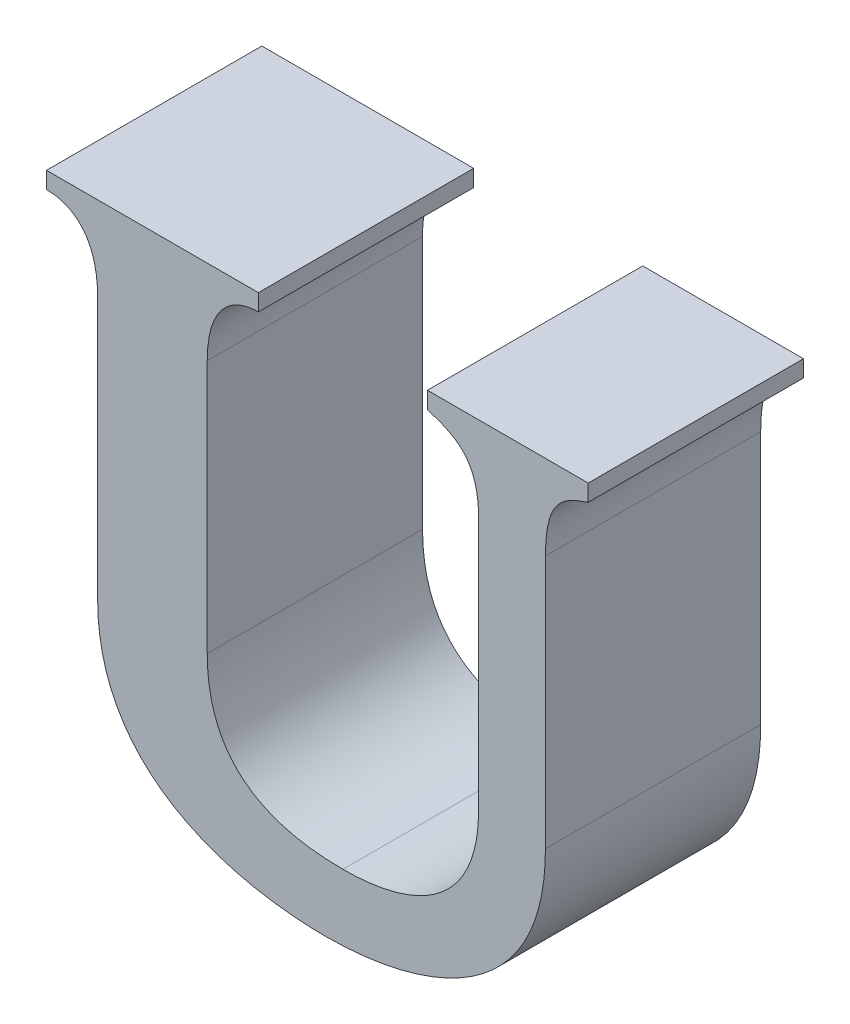
ISO-10303-21;
HEADER;
FILE_DESCRIPTION(('STEP AP214'),'2;1');
FILE_NAME('part.step','',(''),(''),'','','');
FILE_SCHEMA(('AUTOMOTIVE_DESIGN { 1 0 10303 214 1 1 1 1 }'));
ENDSEC;
DATA;
#1=APPLICATION_CONTEXT('core data for automotive mechanical design processes');
#2=APPLICATION_PROTOCOL_DEFINITION('international standard','automotive_design',2000,#1);
#3=PRODUCT_CONTEXT('',#1,'mechanical');
#4=PRODUCT('Part','Part','',(#3));
#5=PRODUCT_RELATED_PRODUCT_CATEGORY('part','',(#4));
#6=PRODUCT_DEFINITION_FORMATION('','',#4);
#7=PRODUCT_DEFINITION_CONTEXT('part definition',#1,'design');
#8=PRODUCT_DEFINITION('design','',#6,#7);
#9=PRODUCT_DEFINITION_SHAPE('','',#8);
#10=(LENGTH_UNIT() NAMED_UNIT(*) SI_UNIT(.MILLI.,.METRE.));
#11=(NAMED_UNIT(*) PLANE_ANGLE_UNIT() SI_UNIT($,.RADIAN.));
#12=(NAMED_UNIT(*) SI_UNIT($,.STERADIAN.) SOLID_ANGLE_UNIT());
#13=UNCERTAINTY_MEASURE_WITH_UNIT(LENGTH_MEASURE(1.E-05),#10,'distance_accuracy_value','');
#14=(GEOMETRIC_REPRESENTATION_CONTEXT(3) GLOBAL_UNCERTAINTY_ASSIGNED_CONTEXT((#13)) GLOBAL_UNIT_ASSIGNED_CONTEXT((#10,
#11,#12)) REPRESENTATION_CONTEXT('',''));
#15=CARTESIAN_POINT('',(0.,0.,0.));
#16=DIRECTION('',(0.,0.,1.));
#17=DIRECTION('',(1.,0.,0.));
#18=AXIS2_PLACEMENT_3D('',#15,#16,#17);
#19=CARTESIAN_POINT('',(3.3288705648969,-0.19257300647474,0.));
#20=DIRECTION('',(0.,1.,0.));
#21=DIRECTION('',(-1.,0.,0.));
#22=AXIS2_PLACEMENT_3D('',#19,#20,#21);
#23=PLANE('',#22);
#24=DIRECTION('',(1.,0.,0.));
#25=VECTOR('',#24,1.);
#26=CARTESIAN_POINT('',(3.2304622745192,-0.19257300647474,0.));
#27=LINE('',#26,#25);
#28=CARTESIAN_POINT('',(3.2304622745192,-0.19257300647474,0.));
#29=VERTEX_POINT('',#28);
#30=CARTESIAN_POINT('',(3.3288705648969,-0.19257300647474,0.));
#31=VERTEX_POINT('',#30);
#32=EDGE_CURVE('E11',#29,#31,#27,.T.);
#33=ORIENTED_EDGE('',*,*,#32,.F.);
#34=DIRECTION('',(0.,0.,1.));
#35=VECTOR('',#34,1.);
#36=CARTESIAN_POINT('',(3.2304622745192,-0.19257300647474,0.));
#37=LINE('',#36,#35);
#38=CARTESIAN_POINT('',(3.2304622745192,-0.19257300647474,0.1));
#39=VERTEX_POINT('',#38);
#40=EDGE_CURVE('E24',#29,#39,#37,.T.);
#41=ORIENTED_EDGE('',*,*,#40,.T.);
#42=DIRECTION('',(-1.,0.,0.));
#43=VECTOR('',#42,1.);
#44=CARTESIAN_POINT('',(3.2304622745192,-0.19257300647474,0.1));
#45=LINE('',#44,#43);
#46=CARTESIAN_POINT('',(3.3288705648969,-0.19257300647474,0.1));
#47=VERTEX_POINT('',#46);
#48=EDGE_CURVE('E160',#47,#39,#45,.T.);
#49=ORIENTED_EDGE('',*,*,#48,.F.);
#50=DIRECTION('',(0.,0.,1.));
#51=VECTOR('',#50,1.);
#52=CARTESIAN_POINT('',(3.3288705648969,-0.19257300647474,0.));
#53=LINE('',#52,#51);
#54=EDGE_CURVE('E361',#31,#47,#53,.T.);
#55=ORIENTED_EDGE('',*,*,#54,.F.);
#56=EDGE_LOOP('',(#33,#41,#49,#55));
#57=FACE_BOUND('',#56,.T.);
#58=ADVANCED_FACE('F17',(#57),#23,.T.);
#59=CARTESIAN_POINT('',(3.3288705648969,-0.200329401425036,0.));
#60=DIRECTION('',(1.,0.,0.));
#61=DIRECTION('',(0.,1.,0.));
#62=AXIS2_PLACEMENT_3D('',#59,#60,#61);
#63=PLANE('',#62);
#64=DIRECTION('',(0.,-1.,0.));
#65=VECTOR('',#64,1.);
#66=CARTESIAN_POINT('',(3.3288705648969,-0.19257300647474,0.));
#67=LINE('',#66,#65);
#68=CARTESIAN_POINT('',(3.3288705648969,-0.200329401425036,0.));
#69=VERTEX_POINT('',#68);
#70=EDGE_CURVE('E359',#31,#69,#67,.T.);
#71=ORIENTED_EDGE('',*,*,#70,.F.);
#72=ORIENTED_EDGE('',*,*,#54,.T.);
#73=DIRECTION('',(0.,1.,0.));
#74=VECTOR('',#73,1.);
#75=CARTESIAN_POINT('',(3.3288705648969,-0.19257300647474,0.1));
#76=LINE('',#75,#74);
#77=CARTESIAN_POINT('',(3.3288705648969,-0.200329401425036,0.1));
#78=VERTEX_POINT('',#77);
#79=EDGE_CURVE('E357',#78,#47,#76,.T.);
#80=ORIENTED_EDGE('',*,*,#79,.F.);
#81=DIRECTION('',(0.,0.,1.));
#82=VECTOR('',#81,1.);
#83=CARTESIAN_POINT('',(3.3288705648969,-0.200329401425036,0.));
#84=LINE('',#83,#82);
#85=EDGE_CURVE('E351',#69,#78,#84,.T.);
#86=ORIENTED_EDGE('',*,*,#85,.F.);
#87=EDGE_LOOP('',(#71,#72,#80,#86));
#88=FACE_BOUND('',#87,.T.);
#89=ADVANCED_FACE('F423',(#88),#63,.T.);
#90=CARTESIAN_POINT('',(3.3051164544872,-0.231839582517053,0.));
#91=CARTESIAN_POINT('',(3.3051164544872,-0.231839582517053,0.1));
#92=CARTESIAN_POINT('',(3.3051164543237,-0.208085759844822,0.));
#93=CARTESIAN_POINT('',(3.3051164543237,-0.208085759844822,0.1));
#94=CARTESIAN_POINT('',(3.3172368912325,-0.200329401179821,0.));
#95=CARTESIAN_POINT('',(3.3172368912325,-0.200329401179821,0.1));
#96=CARTESIAN_POINT('',(3.3288705648969,-0.200329401425036,0.));
#97=CARTESIAN_POINT('',(3.3288705648969,-0.200329401425036,0.1));
#98=B_SPLINE_SURFACE_WITH_KNOTS('',3,1,((#90,#91),(#92,#93),(#94,#95),(#96,#97)),.UNSPECIFIED.,
.F.,.F.,.F.,(4,4),(2,2),(-1.,0.),(0.,0.01),.UNSPECIFIED.);
#99=CARTESIAN_POINT('',(3.3288705648969,-0.200329401425036,0.));
#100=CARTESIAN_POINT('',(3.3172368912325,-0.200329401179821,0.));
#101=CARTESIAN_POINT('',(3.3051164543237,-0.208085759844822,0.));
#102=CARTESIAN_POINT('',(3.3051164544872,-0.231839582517053,0.));
#103=B_SPLINE_CURVE_WITH_KNOTS('',3,(#99,#100,#101,#102),.UNSPECIFIED.,.F.,.F.,(4,4),(0.,1.),.UNSPECIFIED.);
#104=CARTESIAN_POINT('',(3.3051164544872,-0.231839582517053,0.));
#105=VERTEX_POINT('',#104);
#106=EDGE_CURVE('E344',#69,#105,#103,.T.);
#107=CARTESIAN_POINT('',(3.3051164544872,-0.231839582517053,0.1));
#108=CARTESIAN_POINT('',(3.3051164543237,-0.208085759844822,0.1));
#109=CARTESIAN_POINT('',(3.3172368912325,-0.200329401179821,0.1));
#110=CARTESIAN_POINT('',(3.3288705648969,-0.200329401425036,0.1));
#111=B_SPLINE_CURVE_WITH_KNOTS('',3,(#107,#108,#109,#110),.UNSPECIFIED.,.F.,.F.,(4,4),(-1.,0.),.UNSPECIFIED.);
#112=CARTESIAN_POINT('',(3.3051164544872,-0.231839582517053,0.1));
#113=VERTEX_POINT('',#112);
#114=EDGE_CURVE('E339',#113,#78,#111,.T.);
#115=DIRECTION('',(0.,0.,1.));
#116=VECTOR('',#115,1.);
#117=CARTESIAN_POINT('',(3.3051164544872,-0.231839582517053,0.));
#118=LINE('',#117,#116);
#119=EDGE_CURVE('E336',#105,#113,#118,.T.);
#120=ORIENTED_EDGE('',*,*,#106,.F.);
#121=ORIENTED_EDGE('',*,*,#85,.T.);
#122=ORIENTED_EDGE('',*,*,#114,.F.);
#123=ORIENTED_EDGE('',*,*,#119,.F.);
#124=EDGE_LOOP('',(#120,#121,#122,#123));
#125=FACE_BOUND('',#124,.T.);
#126=ADVANCED_FACE('F419',(#125),#98,.T.);
#127=CARTESIAN_POINT('',(3.3051164544873,-0.349639310644154,0.));
#128=DIRECTION('',(1.,0.,0.));
#129=DIRECTION('',(0.,1.,0.));
#130=AXIS2_PLACEMENT_3D('',#127,#128,#129);
#131=PLANE('',#130);
#132=DIRECTION('',(0.,-1.,0.));
#133=VECTOR('',#132,1.);
#134=CARTESIAN_POINT('',(3.3051164544872,-0.231839582517053,0.));
#135=LINE('',#134,#133);
#136=CARTESIAN_POINT('',(3.3051164544872,-0.349639310644154,0.));
#137=VERTEX_POINT('',#136);
#138=EDGE_CURVE('E334',#105,#137,#135,.T.);
#139=ORIENTED_EDGE('',*,*,#138,.F.);
#140=ORIENTED_EDGE('',*,*,#119,.T.);
#141=DIRECTION('',(0.,1.,0.));
#142=VECTOR('',#141,1.);
#143=CARTESIAN_POINT('',(3.3051164544872,-0.231839582517053,0.1));
#144=LINE('',#143,#142);
#145=CARTESIAN_POINT('',(3.3051164544872,-0.349639310644154,0.1));
#146=VERTEX_POINT('',#145);
#147=EDGE_CURVE('E331',#146,#113,#144,.T.);
#148=ORIENTED_EDGE('',*,*,#147,.F.);
#149=DIRECTION('',(0.,0.,1.));
#150=VECTOR('',#149,1.);
#151=CARTESIAN_POINT('',(3.3051164544872,-0.349639310644154,0.));
#152=LINE('',#151,#150);
#153=EDGE_CURVE('E325',#137,#146,#152,.T.);
#154=ORIENTED_EDGE('',*,*,#153,.F.);
#155=EDGE_LOOP('',(#139,#140,#148,#154));
#156=FACE_BOUND('',#155,.T.);
#157=ADVANCED_FACE('F415',(#156),#131,.T.);
#158=CARTESIAN_POINT('',(3.368136960791,-0.404903421996989,0.));
#159=CARTESIAN_POINT('',(3.368136960791,-0.404903421996989,0.1));
#160=CARTESIAN_POINT('',(3.3288705648973,-0.404903421996893,0.));
#161=CARTESIAN_POINT('',(3.3288705648973,-0.404903421996893,0.1));
#162=CARTESIAN_POINT('',(3.3051164544869,-0.388905850656796,0.));
#163=CARTESIAN_POINT('',(3.3051164544869,-0.388905850656796,0.1));
#164=CARTESIAN_POINT('',(3.3051164544872,-0.349639310644154,0.));
#165=CARTESIAN_POINT('',(3.3051164544872,-0.349639310644154,0.1));
#166=B_SPLINE_SURFACE_WITH_KNOTS('',3,1,((#158,#159),(#160,#161),(#162,#163),(#164,#165)),
.UNSPECIFIED.,.F.,.F.,.F.,(4,4),(2,2),(-1.,0.),(0.,0.01),.UNSPECIFIED.);
#167=CARTESIAN_POINT('',(3.3051164544872,-0.349639310644154,0.));
#168=CARTESIAN_POINT('',(3.3051164544869,-0.388905850656796,0.));
#169=CARTESIAN_POINT('',(3.3288705648973,-0.404903421996893,0.));
#170=CARTESIAN_POINT('',(3.368136960791,-0.404903421996989,0.));
#171=B_SPLINE_CURVE_WITH_KNOTS('',3,(#167,#168,#169,#170),.UNSPECIFIED.,.F.,.F.,(4,4),(0.,1.),.UNSPECIFIED.);
#172=CARTESIAN_POINT('',(3.368136960791,-0.404903421996989,0.));
#173=VERTEX_POINT('',#172);
#174=EDGE_CURVE('E318',#137,#173,#171,.T.);
#175=CARTESIAN_POINT('',(3.368136960791,-0.404903421996989,0.1));
#176=CARTESIAN_POINT('',(3.3288705648973,-0.404903421996893,0.1));
#177=CARTESIAN_POINT('',(3.3051164544869,-0.388905850656796,0.1));
#178=CARTESIAN_POINT('',(3.3051164544872,-0.349639310644154,0.1));
#179=B_SPLINE_CURVE_WITH_KNOTS('',3,(#175,#176,#177,#178),.UNSPECIFIED.,.F.,.F.,(4,4),(-1.,0.),.UNSPECIFIED.);
#180=CARTESIAN_POINT('',(3.368136960791,-0.404903421996989,0.1));
#181=VERTEX_POINT('',#180);
#182=EDGE_CURVE('E313',#181,#146,#179,.T.);
#183=DIRECTION('',(0.,0.,1.));
#184=VECTOR('',#183,1.);
#185=CARTESIAN_POINT('',(3.368136960791,-0.404903421996989,0.));
#186=LINE('',#185,#184);
#187=EDGE_CURVE('E307',#173,#181,#186,.T.);
#188=ORIENTED_EDGE('',*,*,#174,.F.);
#189=ORIENTED_EDGE('',*,*,#153,.T.);
#190=ORIENTED_EDGE('',*,*,#182,.F.);
#191=ORIENTED_EDGE('',*,*,#187,.F.);
#192=EDGE_LOOP('',(#188,#189,#190,#191));
#193=FACE_BOUND('',#192,.T.);
#194=ADVANCED_FACE('F411',(#193),#166,.T.);
#195=CARTESIAN_POINT('',(3.431157106796,-0.349639310644154,0.));
#196=CARTESIAN_POINT('',(3.431157106796,-0.349639310644154,0.1));
#197=CARTESIAN_POINT('',(3.4311571075464,-0.354518234323701,0.));
#198=CARTESIAN_POINT('',(3.4311571075464,-0.354518234323701,0.1));
#199=CARTESIAN_POINT('',(3.4307305243869,-0.359418168619129,0.));
#200=CARTESIAN_POINT('',(3.4307305243869,-0.359418168619129,0.1));
#201=CARTESIAN_POINT('',(3.4288220700047,-0.36839607971809,0.));
#202=CARTESIAN_POINT('',(3.4288220700047,-0.36839607971809,0.1));
#203=CARTESIAN_POINT('',(3.4274765798244,-0.372477068080506,0.));
#204=CARTESIAN_POINT('',(3.4274765798244,-0.372477068080506,0.1));
#205=CARTESIAN_POINT('',(3.4229360090901,-0.38174386591969,0.));
#206=CARTESIAN_POINT('',(3.4229360090901,-0.38174386591969,0.1));
#207=CARTESIAN_POINT('',(3.4193436537552,-0.386457460076279,0.));
#208=CARTESIAN_POINT('',(3.4193436537552,-0.386457460076279,0.1));
#209=CARTESIAN_POINT('',(3.4102010834517,-0.394462042644514,0.));
#210=CARTESIAN_POINT('',(3.4102010834517,-0.394462042644514,0.1));
#211=CARTESIAN_POINT('',(3.4048689225399,-0.397501227113499,0.));
#212=CARTESIAN_POINT('',(3.4048689225399,-0.397501227113499,0.1));
#213=CARTESIAN_POINT('',(3.3894157339328,-0.403501972663163,0.));
#214=CARTESIAN_POINT('',(3.3894157339328,-0.403501972663163,0.1));
#215=CARTESIAN_POINT('',(3.3786113415177,-0.404903422153057,0.));
#216=CARTESIAN_POINT('',(3.3786113415177,-0.404903422153057,0.1));
#217=CARTESIAN_POINT('',(3.368136960791,-0.404903421996989,0.));
#218=CARTESIAN_POINT('',(3.368136960791,-0.404903421996989,0.1));
#219=B_SPLINE_SURFACE_WITH_KNOTS('',3,1,((#195,#196),(#197,#198),(#199,#200),(#201,#202),(#203,
#204),(#205,#206),(#207,#208),(#209,#210),(#211,#212),(#213,#214),(#215,#216),(#217,#218)),
.UNSPECIFIED.,.F.,.F.,.F.,(4,2,2,2,2,4),(2,2),(-0.0082792297433474,-0.007008356426133,
-0.0058880631940875,-0.0043194310269377,-0.0027206183706979,0.),(0.,0.01),.UNSPECIFIED.);
#220=CARTESIAN_POINT('',(3.368136960791,-0.404903421996989,0.));
#221=CARTESIAN_POINT('',(3.3786113415177,-0.404903422153057,0.));
#222=CARTESIAN_POINT('',(3.3894157339328,-0.403501972663163,0.));
#223=CARTESIAN_POINT('',(3.4048689225399,-0.397501227113499,0.));
#224=CARTESIAN_POINT('',(3.4102010834517,-0.394462042644514,0.));
#225=CARTESIAN_POINT('',(3.4193436537552,-0.386457460076279,0.));
#226=CARTESIAN_POINT('',(3.4229360090901,-0.38174386591969,0.));
#227=CARTESIAN_POINT('',(3.4274765798244,-0.372477068080506,0.));
#228=CARTESIAN_POINT('',(3.4288220700047,-0.36839607971809,0.));
#229=CARTESIAN_POINT('',(3.4307305243869,-0.359418168619129,0.));
#230=CARTESIAN_POINT('',(3.4311571075464,-0.354518234323701,0.));
#231=CARTESIAN_POINT('',(3.431157106796,-0.349639310644154,0.));
#232=B_SPLINE_CURVE_WITH_KNOTS('',3,(#220,#221,#222,#223,#224,#225,#226,#227,#228,#229,#230,
#231),.UNSPECIFIED.,.F.,.F.,(4,2,2,2,2,4),(0.,0.0027206183706979,0.0043194310269377,
0.0058880631940875,0.007008356426133,0.0082792297433474),.UNSPECIFIED.);
#233=CARTESIAN_POINT('',(3.431157106796,-0.349639310644154,0.));
#234=VERTEX_POINT('',#233);
#235=EDGE_CURVE('E300',#173,#234,#232,.T.);
#236=CARTESIAN_POINT('',(3.431157106796,-0.349639310644154,0.1));
#237=CARTESIAN_POINT('',(3.4311571075464,-0.354518234323701,0.1));
#238=CARTESIAN_POINT('',(3.4307305243869,-0.359418168619129,0.1));
#239=CARTESIAN_POINT('',(3.4288220700047,-0.36839607971809,0.1));
#240=CARTESIAN_POINT('',(3.4274765798244,-0.372477068080506,0.1));
#241=CARTESIAN_POINT('',(3.4229360090901,-0.38174386591969,0.1));
#242=CARTESIAN_POINT('',(3.4193436537552,-0.386457460076279,0.1));
#243=CARTESIAN_POINT('',(3.4102010834517,-0.394462042644514,0.1));
#244=CARTESIAN_POINT('',(3.4048689225399,-0.397501227113499,0.1));
#245=CARTESIAN_POINT('',(3.3894157339328,-0.403501972663163,0.1));
#246=CARTESIAN_POINT('',(3.3786113415177,-0.404903422153057,0.1));
#247=CARTESIAN_POINT('',(3.368136960791,-0.404903421996989,0.1));
#248=B_SPLINE_CURVE_WITH_KNOTS('',3,(#236,#237,#238,#239,#240,#241,#242,#243,#244,#245,#246,
#247),.UNSPECIFIED.,.F.,.F.,(4,2,2,2,2,4),(-0.0082792297433474,-0.007008356426133,
-0.0058880631940875,-0.0043194310269377,-0.0027206183706979,0.),.UNSPECIFIED.);
#249=CARTESIAN_POINT('',(3.431157106796,-0.349639310644154,0.1));
#250=VERTEX_POINT('',#249);
#251=EDGE_CURVE('E295',#250,#181,#248,.T.);
#252=DIRECTION('',(0.,0.,1.));
#253=VECTOR('',#252,1.);
#254=CARTESIAN_POINT('',(3.431157106796,-0.349639310644154,0.));
#255=LINE('',#254,#253);
#256=EDGE_CURVE('E292',#234,#250,#255,.T.);
#257=ORIENTED_EDGE('',*,*,#235,.F.);
#258=ORIENTED_EDGE('',*,*,#187,.T.);
#259=ORIENTED_EDGE('',*,*,#251,.F.);
#260=ORIENTED_EDGE('',*,*,#256,.F.);
#261=EDGE_LOOP('',(#257,#258,#259,#260));
#262=FACE_BOUND('',#261,.T.);
#263=ADVANCED_FACE('F407',(#262),#219,.T.);
#264=CARTESIAN_POINT('',(3.431157106796,-0.231839582517053,0.));
#265=DIRECTION('',(-1.,0.,0.));
#266=DIRECTION('',(0.,-1.,0.));
#267=AXIS2_PLACEMENT_3D('',#264,#265,#266);
#268=PLANE('',#267);
#269=DIRECTION('',(0.,1.,0.));
#270=VECTOR('',#269,1.);
#271=CARTESIAN_POINT('',(3.431157106796,-0.349639310644154,0.));
#272=LINE('',#271,#270);
#273=CARTESIAN_POINT('',(3.431157106796,-0.231839582517053,0.));
#274=VERTEX_POINT('',#273);
#275=EDGE_CURVE('E290',#234,#274,#272,.T.);
#276=ORIENTED_EDGE('',*,*,#275,.F.);
#277=ORIENTED_EDGE('',*,*,#256,.T.);
#278=DIRECTION('',(0.,-1.,0.));
#279=VECTOR('',#278,1.);
#280=CARTESIAN_POINT('',(3.431157106796,-0.349639310644154,0.1));
#281=LINE('',#280,#279);
#282=CARTESIAN_POINT('',(3.431157106796,-0.231839582517053,0.1));
#283=VERTEX_POINT('',#282);
#284=EDGE_CURVE('E287',#283,#250,#281,.T.);
#285=ORIENTED_EDGE('',*,*,#284,.F.);
#286=DIRECTION('',(0.,0.,1.));
#287=VECTOR('',#286,1.);
#288=CARTESIAN_POINT('',(3.431157106796,-0.231839582517053,0.));
#289=LINE('',#288,#287);
#290=EDGE_CURVE('E281',#274,#283,#289,.T.);
#291=ORIENTED_EDGE('',*,*,#290,.F.);
#292=EDGE_LOOP('',(#276,#277,#285,#291));
#293=FACE_BOUND('',#292,.T.);
#294=ADVANCED_FACE('F403',(#293),#268,.T.);
#295=CARTESIAN_POINT('',(3.407403356684,-0.200329401425036,0.));
#296=CARTESIAN_POINT('',(3.407403356684,-0.200329401425036,0.1));
#297=CARTESIAN_POINT('',(3.4190384723642,-0.204207508464441,0.));
#298=CARTESIAN_POINT('',(3.4190384723642,-0.204207508464441,0.1));
#299=CARTESIAN_POINT('',(3.4311571075037,-0.2080857603454,0.));
#300=CARTESIAN_POINT('',(3.4311571075037,-0.2080857603454,0.1));
#301=CARTESIAN_POINT('',(3.431157106796,-0.231839582517053,0.));
#302=CARTESIAN_POINT('',(3.431157106796,-0.231839582517053,0.1));
#303=B_SPLINE_SURFACE_WITH_KNOTS('',3,1,((#295,#296),(#297,#298),(#299,#300),(#301,#302)),
.UNSPECIFIED.,.F.,.F.,.F.,(4,4),(2,2),(-1.,0.),(0.,0.01),.UNSPECIFIED.);
#304=CARTESIAN_POINT('',(3.431157106796,-0.231839582517053,0.));
#305=CARTESIAN_POINT('',(3.4311571075037,-0.2080857603454,0.));
#306=CARTESIAN_POINT('',(3.4190384723642,-0.204207508464441,0.));
#307=CARTESIAN_POINT('',(3.407403356684,-0.200329401425036,0.));
#308=B_SPLINE_CURVE_WITH_KNOTS('',3,(#304,#305,#306,#307),.UNSPECIFIED.,.F.,.F.,(4,4),(0.,1.),.UNSPECIFIED.);
#309=CARTESIAN_POINT('',(3.407403356684,-0.200329401425036,0.));
#310=VERTEX_POINT('',#309);
#311=EDGE_CURVE('E274',#274,#310,#308,.T.);
#312=CARTESIAN_POINT('',(3.407403356684,-0.200329401425036,0.1));
#313=CARTESIAN_POINT('',(3.4190384723642,-0.204207508464441,0.1));
#314=CARTESIAN_POINT('',(3.4311571075037,-0.2080857603454,0.1));
#315=CARTESIAN_POINT('',(3.431157106796,-0.231839582517053,0.1));
#316=B_SPLINE_CURVE_WITH_KNOTS('',3,(#312,#313,#314,#315),.UNSPECIFIED.,.F.,.F.,(4,4),(-1.,0.),.UNSPECIFIED.);
#317=CARTESIAN_POINT('',(3.407403356684,-0.200329401425036,0.1));
#318=VERTEX_POINT('',#317);
#319=EDGE_CURVE('E269',#318,#283,#316,.T.);
#320=DIRECTION('',(0.,0.,1.));
#321=VECTOR('',#320,1.);
#322=CARTESIAN_POINT('',(3.407403356684,-0.200329401425036,0.));
#323=LINE('',#322,#321);
#324=EDGE_CURVE('E266',#310,#318,#323,.T.);
#325=ORIENTED_EDGE('',*,*,#311,.F.);
#326=ORIENTED_EDGE('',*,*,#290,.T.);
#327=ORIENTED_EDGE('',*,*,#319,.F.);
#328=ORIENTED_EDGE('',*,*,#324,.F.);
#329=EDGE_LOOP('',(#325,#326,#327,#328));
#330=FACE_BOUND('',#329,.T.);
#331=ADVANCED_FACE('F399',(#330),#303,.T.);
#332=CARTESIAN_POINT('',(3.407403356684,-0.19257300647474,0.));
#333=DIRECTION('',(-1.,0.,0.));
#334=DIRECTION('',(0.,-1.,0.));
#335=AXIS2_PLACEMENT_3D('',#332,#333,#334);
#336=PLANE('',#335);
#337=DIRECTION('',(0.,1.,0.));
#338=VECTOR('',#337,1.);
#339=CARTESIAN_POINT('',(3.407403356684,-0.200329401425036,0.));
#340=LINE('',#339,#338);
#341=CARTESIAN_POINT('',(3.407403356684,-0.19257300647474,0.));
#342=VERTEX_POINT('',#341);
#343=EDGE_CURVE('E264',#310,#342,#340,.T.);
#344=ORIENTED_EDGE('',*,*,#343,.F.);
#345=ORIENTED_EDGE('',*,*,#324,.T.);
#346=DIRECTION('',(0.,-1.,0.));
#347=VECTOR('',#346,1.);
#348=CARTESIAN_POINT('',(3.407403356684,-0.200329401425036,0.1));
#349=LINE('',#348,#347);
#350=CARTESIAN_POINT('',(3.407403356684,-0.19257300647474,0.1));
#351=VERTEX_POINT('',#350);
#352=EDGE_CURVE('E261',#351,#318,#349,.T.);
#353=ORIENTED_EDGE('',*,*,#352,.F.);
#354=DIRECTION('',(0.,0.,1.));
#355=VECTOR('',#354,1.);
#356=CARTESIAN_POINT('',(3.407403356684,-0.19257300647474,0.));
#357=LINE('',#356,#355);
#358=EDGE_CURVE('E258',#342,#351,#357,.T.);
#359=ORIENTED_EDGE('',*,*,#358,.F.);
#360=EDGE_LOOP('',(#344,#345,#353,#359));
#361=FACE_BOUND('',#360,.T.);
#362=ADVANCED_FACE('F395',(#361),#336,.T.);
#363=CARTESIAN_POINT('',(3.4820586175472,-0.19257300647474,0.));
#364=DIRECTION('',(0.,1.,0.));
#365=DIRECTION('',(-1.,0.,0.));
#366=AXIS2_PLACEMENT_3D('',#363,#364,#365);
#367=PLANE('',#366);
#368=DIRECTION('',(1.,0.,0.));
#369=VECTOR('',#368,1.);
#370=CARTESIAN_POINT('',(3.407403356684,-0.19257300647474,0.));
#371=LINE('',#370,#369);
#372=CARTESIAN_POINT('',(3.4820586175472,-0.19257300647474,0.));
#373=VERTEX_POINT('',#372);
#374=EDGE_CURVE('E256',#342,#373,#371,.T.);
#375=ORIENTED_EDGE('',*,*,#374,.F.);
#376=ORIENTED_EDGE('',*,*,#358,.T.);
#377=DIRECTION('',(-1.,0.,0.));
#378=VECTOR('',#377,1.);
#379=CARTESIAN_POINT('',(3.407403356684,-0.19257300647474,0.1));
#380=LINE('',#379,#378);
#381=CARTESIAN_POINT('',(3.4820586175472,-0.19257300647474,0.1));
#382=VERTEX_POINT('',#381);
#383=EDGE_CURVE('E253',#382,#351,#380,.T.);
#384=ORIENTED_EDGE('',*,*,#383,.F.);
#385=DIRECTION('',(0.,0.,1.));
#386=VECTOR('',#385,1.);
#387=CARTESIAN_POINT('',(3.4820586175472,-0.19257300647474,0.));
#388=LINE('',#387,#386);
#389=EDGE_CURVE('E250',#373,#382,#388,.T.);
#390=ORIENTED_EDGE('',*,*,#389,.F.);
#391=EDGE_LOOP('',(#375,#376,#384,#390));
#392=FACE_BOUND('',#391,.T.);
#393=ADVANCED_FACE('F391',(#392),#367,.T.);
#394=CARTESIAN_POINT('',(3.4820586175472,-0.200329401425036,0.));
#395=DIRECTION('',(1.,0.,0.));
#396=DIRECTION('',(0.,1.,0.));
#397=AXIS2_PLACEMENT_3D('',#394,#395,#396);
#398=PLANE('',#397);
#399=DIRECTION('',(0.,-1.,0.));
#400=VECTOR('',#399,1.);
#401=CARTESIAN_POINT('',(3.4820586175472,-0.19257300647474,0.));
#402=LINE('',#401,#400);
#403=CARTESIAN_POINT('',(3.4820586175472,-0.200329401425036,0.));
#404=VERTEX_POINT('',#403);
#405=EDGE_CURVE('E248',#373,#404,#402,.T.);
#406=ORIENTED_EDGE('',*,*,#405,.F.);
#407=ORIENTED_EDGE('',*,*,#389,.T.);
#408=DIRECTION('',(0.,1.,0.));
#409=VECTOR('',#408,1.);
#410=CARTESIAN_POINT('',(3.4820586175472,-0.19257300647474,0.1));
#411=LINE('',#410,#409);
#412=CARTESIAN_POINT('',(3.4820586175472,-0.200329401425036,0.1));
#413=VERTEX_POINT('',#412);
#414=EDGE_CURVE('E245',#413,#382,#411,.T.);
#415=ORIENTED_EDGE('',*,*,#414,.F.);
#416=DIRECTION('',(0.,0.,1.));
#417=VECTOR('',#416,1.);
#418=CARTESIAN_POINT('',(3.4820586175472,-0.200329401425036,0.));
#419=LINE('',#418,#417);
#420=EDGE_CURVE('E239',#404,#413,#419,.T.);
#421=ORIENTED_EDGE('',*,*,#420,.F.);
#422=EDGE_LOOP('',(#406,#407,#415,#421));
#423=FACE_BOUND('',#422,.T.);
#424=ADVANCED_FACE('F387',(#423),#398,.T.);
#425=CARTESIAN_POINT('',(3.4621834792531,-0.231839582517053,0.));
#426=CARTESIAN_POINT('',(3.4621834792531,-0.231839582517053,0.1));
#427=CARTESIAN_POINT('',(3.4621834794163,-0.208085760764237,0.));
#428=CARTESIAN_POINT('',(3.4621834794163,-0.208085760764237,0.1));
#429=CARTESIAN_POINT('',(3.4704249439635,-0.204207509070737,0.));
#430=CARTESIAN_POINT('',(3.4704249439635,-0.204207509070737,0.1));
#431=CARTESIAN_POINT('',(3.4820586175472,-0.200329401425036,0.));
#432=CARTESIAN_POINT('',(3.4820586175472,-0.200329401425036,0.1));
#433=B_SPLINE_SURFACE_WITH_KNOTS('',3,1,((#425,#426),(#427,#428),(#429,#430),(#431,#432)),
.UNSPECIFIED.,.F.,.F.,.F.,(4,4),(2,2),(-1.,0.),(0.,0.01),.UNSPECIFIED.);
#434=CARTESIAN_POINT('',(3.4820586175472,-0.200329401425036,0.));
#435=CARTESIAN_POINT('',(3.4704249439635,-0.204207509070737,0.));
#436=CARTESIAN_POINT('',(3.4621834794163,-0.208085760764237,0.));
#437=CARTESIAN_POINT('',(3.4621834792531,-0.231839582517053,0.));
#438=B_SPLINE_CURVE_WITH_KNOTS('',3,(#434,#435,#436,#437),.UNSPECIFIED.,.F.,.F.,(4,4),(0.,1.),.UNSPECIFIED.);
#439=CARTESIAN_POINT('',(3.4621834792531,-0.231839582517053,0.));
#440=VERTEX_POINT('',#439);
#441=EDGE_CURVE('E232',#404,#440,#438,.T.);
#442=CARTESIAN_POINT('',(3.4621834792531,-0.231839582517053,0.1));
#443=CARTESIAN_POINT('',(3.4621834794163,-0.208085760764237,0.1));
#444=CARTESIAN_POINT('',(3.4704249439635,-0.204207509070737,0.1));
#445=CARTESIAN_POINT('',(3.4820586175472,-0.200329401425036,0.1));
#446=B_SPLINE_CURVE_WITH_KNOTS('',3,(#442,#443,#444,#445),.UNSPECIFIED.,.F.,.F.,(4,4),(-1.,0.),.UNSPECIFIED.);
#447=CARTESIAN_POINT('',(3.4621834792531,-0.231839582517053,0.1));
#448=VERTEX_POINT('',#447);
#449=EDGE_CURVE('E227',#448,#413,#446,.T.);
#450=DIRECTION('',(0.,0.,1.));
#451=VECTOR('',#450,1.);
#452=CARTESIAN_POINT('',(3.4621834792531,-0.231839582517053,0.));
#453=LINE('',#452,#451);
#454=EDGE_CURVE('E224',#440,#448,#453,.T.);
#455=ORIENTED_EDGE('',*,*,#441,.F.);
#456=ORIENTED_EDGE('',*,*,#420,.T.);
#457=ORIENTED_EDGE('',*,*,#449,.F.);
#458=ORIENTED_EDGE('',*,*,#454,.F.);
#459=EDGE_LOOP('',(#455,#456,#457,#458));
#460=FACE_BOUND('',#459,.T.);
#461=ADVANCED_FACE('F383',(#460),#433,.T.);
#462=CARTESIAN_POINT('',(3.4621834792531,-0.349639310644154,0.));
#463=DIRECTION('',(1.,0.,0.));
#464=DIRECTION('',(0.,1.,0.));
#465=AXIS2_PLACEMENT_3D('',#462,#463,#464);
#466=PLANE('',#465);
#467=DIRECTION('',(0.,-1.,0.));
#468=VECTOR('',#467,1.);
#469=CARTESIAN_POINT('',(3.4621834792531,-0.231839582517053,0.));
#470=LINE('',#469,#468);
#471=CARTESIAN_POINT('',(3.4621834792531,-0.349639310644154,0.));
#472=VERTEX_POINT('',#471);
#473=EDGE_CURVE('E222',#440,#472,#470,.T.);
#474=ORIENTED_EDGE('',*,*,#473,.F.);
#475=ORIENTED_EDGE('',*,*,#454,.T.);
#476=DIRECTION('',(0.,1.,0.));
#477=VECTOR('',#476,1.);
#478=CARTESIAN_POINT('',(3.4621834792531,-0.231839582517053,0.1));
#479=LINE('',#478,#477);
#480=CARTESIAN_POINT('',(3.4621834792531,-0.349639310644154,0.1));
#481=VERTEX_POINT('',#480);
#482=EDGE_CURVE('E219',#481,#448,#479,.T.);
#483=ORIENTED_EDGE('',*,*,#482,.F.);
#484=DIRECTION('',(0.,0.,1.));
#485=VECTOR('',#484,1.);
#486=CARTESIAN_POINT('',(3.4621834792531,-0.349639310644154,0.));
#487=LINE('',#486,#485);
#488=EDGE_CURVE('E213',#472,#481,#487,.T.);
#489=ORIENTED_EDGE('',*,*,#488,.F.);
#490=EDGE_LOOP('',(#474,#475,#483,#489));
#491=FACE_BOUND('',#490,.T.);
#492=ADVANCED_FACE('F379',(#491),#466,.T.);
#493=CARTESIAN_POINT('',(3.3603804577506,-0.435928821649544,0.));
#494=CARTESIAN_POINT('',(3.3603804577506,-0.435928821649544,0.1));
#495=CARTESIAN_POINT('',(3.399646854929,-0.435928822581481,0.));
#496=CARTESIAN_POINT('',(3.399646854929,-0.435928822581481,0.1));
#497=CARTESIAN_POINT('',(3.4621834803079,-0.420416067777872,0.));
#498=CARTESIAN_POINT('',(3.4621834803079,-0.420416067777872,0.1));
#499=CARTESIAN_POINT('',(3.4621834792531,-0.349639310644154,0.));
#500=CARTESIAN_POINT('',(3.4621834792531,-0.349639310644154,0.1));
#501=B_SPLINE_SURFACE_WITH_KNOTS('',3,1,((#493,#494),(#495,#496),(#497,#498),(#499,#500)),
.UNSPECIFIED.,.F.,.F.,.F.,(4,4),(2,2),(-1.,0.),(0.,0.01),.UNSPECIFIED.);
#502=CARTESIAN_POINT('',(3.4621834792531,-0.349639310644154,0.));
#503=CARTESIAN_POINT('',(3.4621834803079,-0.420416067777872,0.));
#504=CARTESIAN_POINT('',(3.399646854929,-0.435928822581481,0.));
#505=CARTESIAN_POINT('',(3.3603804577506,-0.435928821649544,0.));
#506=B_SPLINE_CURVE_WITH_KNOTS('',3,(#502,#503,#504,#505),.UNSPECIFIED.,.F.,.F.,(4,4),(0.,1.),.UNSPECIFIED.);
#507=CARTESIAN_POINT('',(3.3603804577506,-0.435928821649544,0.));
#508=VERTEX_POINT('',#507);
#509=EDGE_CURVE('E206',#472,#508,#506,.T.);
#510=CARTESIAN_POINT('',(3.3603804577506,-0.435928821649544,0.1));
#511=CARTESIAN_POINT('',(3.399646854929,-0.435928822581481,0.1));
#512=CARTESIAN_POINT('',(3.4621834803079,-0.420416067777872,0.1));
#513=CARTESIAN_POINT('',(3.4621834792531,-0.349639310644154,0.1));
#514=B_SPLINE_CURVE_WITH_KNOTS('',3,(#510,#511,#512,#513),.UNSPECIFIED.,.F.,.F.,(4,4),(-1.,0.),.UNSPECIFIED.);
#515=CARTESIAN_POINT('',(3.3603804577506,-0.435928821649544,0.1));
#516=VERTEX_POINT('',#515);
#517=EDGE_CURVE('E201',#516,#481,#514,.T.);
#518=DIRECTION('',(0.,0.,1.));
#519=VECTOR('',#518,1.);
#520=CARTESIAN_POINT('',(3.3603804577506,-0.435928821649544,0.));
#521=LINE('',#520,#519);
#522=EDGE_CURVE('E195',#508,#516,#521,.T.);
#523=ORIENTED_EDGE('',*,*,#509,.F.);
#524=ORIENTED_EDGE('',*,*,#488,.T.);
#525=ORIENTED_EDGE('',*,*,#517,.F.);
#526=ORIENTED_EDGE('',*,*,#522,.F.);
#527=EDGE_LOOP('',(#523,#524,#525,#526));
#528=FACE_BOUND('',#527,.T.);
#529=ADVANCED_FACE('F375',(#528),#501,.T.);
#530=CARTESIAN_POINT('',(3.2542163849288,-0.353517562164374,0.));
#531=CARTESIAN_POINT('',(3.2542163849288,-0.353517562164374,0.1));
#532=CARTESIAN_POINT('',(3.2542163853909,-0.42041606461394,0.));
#533=CARTESIAN_POINT('',(3.2542163853909,-0.42041606461394,0.1));
#534=CARTESIAN_POINT('',(3.3172368912325,-0.435928820363833,0.));
#535=CARTESIAN_POINT('',(3.3172368912325,-0.435928820363833,0.1));
#536=CARTESIAN_POINT('',(3.3603804577506,-0.435928821649544,0.));
#537=CARTESIAN_POINT('',(3.3603804577506,-0.435928821649544,0.1));
#538=B_SPLINE_SURFACE_WITH_KNOTS('',3,1,((#530,#531),(#532,#533),(#534,#535),(#536,#537)),
.UNSPECIFIED.,.F.,.F.,.F.,(4,4),(2,2),(-1.,0.),(0.,0.01),.UNSPECIFIED.);
#539=CARTESIAN_POINT('',(3.3603804577506,-0.435928821649544,0.));
#540=CARTESIAN_POINT('',(3.3172368912325,-0.435928820363833,0.));
#541=CARTESIAN_POINT('',(3.2542163853909,-0.42041606461394,0.));
#542=CARTESIAN_POINT('',(3.2542163849288,-0.353517562164374,0.));
#543=B_SPLINE_CURVE_WITH_KNOTS('',3,(#539,#540,#541,#542),.UNSPECIFIED.,.F.,.F.,(4,4),(0.,1.),.UNSPECIFIED.);
#544=CARTESIAN_POINT('',(3.2542163849288,-0.353517562164374,0.));
#545=VERTEX_POINT('',#544);
#546=EDGE_CURVE('E188',#508,#545,#543,.T.);
#547=CARTESIAN_POINT('',(3.2542163849288,-0.353517562164374,0.1));
#548=CARTESIAN_POINT('',(3.2542163853909,-0.42041606461394,0.1));
#549=CARTESIAN_POINT('',(3.3172368912325,-0.435928820363833,0.1));
#550=CARTESIAN_POINT('',(3.3603804577506,-0.435928821649544,0.1));
#551=B_SPLINE_CURVE_WITH_KNOTS('',3,(#547,#548,#549,#550),.UNSPECIFIED.,.F.,.F.,(4,4),(-1.,0.),.UNSPECIFIED.);
#552=CARTESIAN_POINT('',(3.2542163849288,-0.353517562164374,0.1));
#553=VERTEX_POINT('',#552);
#554=EDGE_CURVE('E183',#553,#516,#551,.T.);
#555=DIRECTION('',(0.,0.,1.));
#556=VECTOR('',#555,1.);
#557=CARTESIAN_POINT('',(3.2542163849288,-0.353517562164374,0.));
#558=LINE('',#557,#556);
#559=EDGE_CURVE('E180',#545,#553,#558,.T.);
#560=ORIENTED_EDGE('',*,*,#546,.F.);
#561=ORIENTED_EDGE('',*,*,#522,.T.);
#562=ORIENTED_EDGE('',*,*,#554,.F.);
#563=ORIENTED_EDGE('',*,*,#559,.F.);
#564=EDGE_LOOP('',(#560,#561,#562,#563));
#565=FACE_BOUND('',#564,.T.);
#566=ADVANCED_FACE('F371',(#565),#538,.T.);
#567=CARTESIAN_POINT('',(3.2542163849288,-0.231839582517053,0.));
#568=DIRECTION('',(-1.,0.,0.));
#569=DIRECTION('',(0.,-1.,0.));
#570=AXIS2_PLACEMENT_3D('',#567,#568,#569);
#571=PLANE('',#570);
#572=DIRECTION('',(0.,1.,0.));
#573=VECTOR('',#572,1.);
#574=CARTESIAN_POINT('',(3.2542163849288,-0.353517562164374,0.));
#575=LINE('',#574,#573);
#576=CARTESIAN_POINT('',(3.2542163849288,-0.231839582517053,0.));
#577=VERTEX_POINT('',#576);
#578=EDGE_CURVE('E178',#545,#577,#575,.T.);
#579=ORIENTED_EDGE('',*,*,#578,.F.);
#580=ORIENTED_EDGE('',*,*,#559,.T.);
#581=DIRECTION('',(0.,-1.,0.));
#582=VECTOR('',#581,1.);
#583=CARTESIAN_POINT('',(3.2542163849288,-0.353517562164374,0.1));
#584=LINE('',#583,#582);
#585=CARTESIAN_POINT('',(3.2542163849288,-0.231839582517053,0.1));
#586=VERTEX_POINT('',#585);
#587=EDGE_CURVE('E176',#586,#553,#584,.T.);
#588=ORIENTED_EDGE('',*,*,#587,.F.);
#589=DIRECTION('',(0.,0.,1.));
#590=VECTOR('',#589,1.);
#591=CARTESIAN_POINT('',(3.2542163849288,-0.231839582517053,0.));
#592=LINE('',#591,#590);
#593=EDGE_CURVE('E145',#577,#586,#592,.T.);
#594=ORIENTED_EDGE('',*,*,#593,.F.);
#595=EDGE_LOOP('',(#579,#580,#588,#594));
#596=FACE_BOUND('',#595,.T.);
#597=ADVANCED_FACE('F369',(#596),#571,.T.);
#598=CARTESIAN_POINT('',(3.2304622745192,-0.200329401425036,0.));
#599=CARTESIAN_POINT('',(3.2304622745192,-0.200329401425036,0.1));
#600=CARTESIAN_POINT('',(3.2324813179033,-0.20032940166222,0.));
#601=CARTESIAN_POINT('',(3.2324813179033,-0.20032940166222,0.1));
#602=CARTESIAN_POINT('',(3.2345000518433,-0.200544687792159,0.));
#603=CARTESIAN_POINT('',(3.2345000518433,-0.200544687792159,0.1));
#604=CARTESIAN_POINT('',(3.2384304521226,-0.201500328634421,0.));
#605=CARTESIAN_POINT('',(3.2384304521226,-0.201500328634421,0.1));
#606=CARTESIAN_POINT('',(3.2403126658183,-0.202235551670305,0.));
#607=CARTESIAN_POINT('',(3.2403126658183,-0.202235551670305,0.1));
#608=CARTESIAN_POINT('',(3.2444263268398,-0.204625613052681,0.));
#609=CARTESIAN_POINT('',(3.2444263268398,-0.204625613052681,0.1));
#610=CARTESIAN_POINT('',(3.2464253087192,-0.206437103082117,0.));
#611=CARTESIAN_POINT('',(3.2464253087192,-0.206437103082117,0.1));
#612=CARTESIAN_POINT('',(3.2500219520523,-0.211197311393097,0.));
#613=CARTESIAN_POINT('',(3.2500219520523,-0.211197311393097,0.1));
#614=CARTESIAN_POINT('',(3.2513854977378,-0.21416644715121,0.));
#615=CARTESIAN_POINT('',(3.2513854977378,-0.21416644715121,0.1));
#616=CARTESIAN_POINT('',(3.2537295229402,-0.221911763733067,0.));
#617=CARTESIAN_POINT('',(3.2537295229402,-0.221911763733067,0.1));
#618=CARTESIAN_POINT('',(3.2542163848755,-0.226980536081472,0.));
#619=CARTESIAN_POINT('',(3.2542163848755,-0.226980536081472,0.1));
#620=CARTESIAN_POINT('',(3.2542163849288,-0.231839582517053,0.));
#621=CARTESIAN_POINT('',(3.2542163849288,-0.231839582517053,0.1));
#622=B_SPLINE_SURFACE_WITH_KNOTS('',3,1,((#598,#599),(#600,#601),(#602,#603),(#604,#605),(#606,
#607),(#608,#609),(#610,#611),(#612,#613),(#614,#615),(#616,#617),(#618,#619),(#620,#621)),
.UNSPECIFIED.,.F.,.F.,.F.,(4,2,2,2,2,4),(2,2),(-0.0038674048402713,-0.0033416688918967,
-0.0028140386328824,-0.0021028661605547,-0.0012620899832507,0.),(0.,0.01),.UNSPECIFIED.);
#623=CARTESIAN_POINT('',(3.2542163849288,-0.231839582517053,0.));
#624=CARTESIAN_POINT('',(3.2542163848755,-0.226980536081472,0.));
#625=CARTESIAN_POINT('',(3.2537295229402,-0.221911763733067,0.));
#626=CARTESIAN_POINT('',(3.2513854977378,-0.21416644715121,0.));
#627=CARTESIAN_POINT('',(3.2500219520523,-0.211197311393097,0.));
#628=CARTESIAN_POINT('',(3.2464253087192,-0.206437103082117,0.));
#629=CARTESIAN_POINT('',(3.2444263268398,-0.204625613052681,0.));
#630=CARTESIAN_POINT('',(3.2403126658183,-0.202235551670305,0.));
#631=CARTESIAN_POINT('',(3.2384304521226,-0.201500328634421,0.));
#632=CARTESIAN_POINT('',(3.2345000518433,-0.200544687792159,0.));
#633=CARTESIAN_POINT('',(3.2324813179033,-0.20032940166222,0.));
#634=CARTESIAN_POINT('',(3.2304622745192,-0.200329401425036,0.));
#635=B_SPLINE_CURVE_WITH_KNOTS('',3,(#623,#624,#625,#626,#627,#628,#629,#630,#631,#632,#633,
#634),.UNSPECIFIED.,.F.,.F.,(4,2,2,2,2,4),(0.,0.0012620899832507,0.0021028661605547,
0.0028140386328824,0.0033416688918967,0.0038674048402713),.UNSPECIFIED.);
#636=CARTESIAN_POINT('',(3.2304622745192,-0.200329401425036,0.));
#637=VERTEX_POINT('',#636);
#638=EDGE_CURVE('E149',#577,#637,#635,.T.);
#639=CARTESIAN_POINT('',(3.2304622745192,-0.200329401425036,0.1));
#640=CARTESIAN_POINT('',(3.2324813179033,-0.20032940166222,0.1));
#641=CARTESIAN_POINT('',(3.2345000518433,-0.200544687792159,0.1));
#642=CARTESIAN_POINT('',(3.2384304521226,-0.201500328634421,0.1));
#643=CARTESIAN_POINT('',(3.2403126658183,-0.202235551670305,0.1));
#644=CARTESIAN_POINT('',(3.2444263268398,-0.204625613052681,0.1));
#645=CARTESIAN_POINT('',(3.2464253087192,-0.206437103082117,0.1));
#646=CARTESIAN_POINT('',(3.2500219520523,-0.211197311393097,0.1));
#647=CARTESIAN_POINT('',(3.2513854977378,-0.21416644715121,0.1));
#648=CARTESIAN_POINT('',(3.2537295229402,-0.221911763733067,0.1));
#649=CARTESIAN_POINT('',(3.2542163848755,-0.226980536081472,0.1));
#650=CARTESIAN_POINT('',(3.2542163849288,-0.231839582517053,0.1));
#651=B_SPLINE_CURVE_WITH_KNOTS('',3,(#639,#640,#641,#642,#643,#644,#645,#646,#647,#648,#649,
#650),.UNSPECIFIED.,.F.,.F.,(4,2,2,2,2,4),(-0.0038674048402713,-0.0033416688918967,
-0.0028140386328824,-0.0021028661605547,-0.0012620899832507,0.),.UNSPECIFIED.);
#652=CARTESIAN_POINT('',(3.2304622745192,-0.200329401425036,0.1));
#653=VERTEX_POINT('',#652);
#654=EDGE_CURVE('E138',#653,#586,#651,.T.);
#655=DIRECTION('',(0.,0.,1.));
#656=VECTOR('',#655,1.);
#657=CARTESIAN_POINT('',(3.2304622745192,-0.200329401425036,0.));
#658=LINE('',#657,#656);
#659=EDGE_CURVE('E142',#637,#653,#658,.T.);
#660=ORIENTED_EDGE('',*,*,#638,.F.);
#661=ORIENTED_EDGE('',*,*,#593,.T.);
#662=ORIENTED_EDGE('',*,*,#654,.F.);
#663=ORIENTED_EDGE('',*,*,#659,.F.);
#664=EDGE_LOOP('',(#660,#661,#662,#663));
#665=FACE_BOUND('',#664,.T.);
#666=ADVANCED_FACE('F141',(#665),#622,.T.);
#667=CARTESIAN_POINT('',(3.2304622745192,-0.19257300647474,0.));
#668=DIRECTION('',(-1.,0.,0.));
#669=DIRECTION('',(0.,-1.,0.));
#670=AXIS2_PLACEMENT_3D('',#667,#668,#669);
#671=PLANE('',#670);
#672=DIRECTION('',(0.,1.,0.));
#673=VECTOR('',#672,1.);
#674=CARTESIAN_POINT('',(3.2304622745192,-0.200329401425036,0.));
#675=LINE('',#674,#673);
#676=EDGE_CURVE('E155',#637,#29,#675,.T.);
#677=ORIENTED_EDGE('',*,*,#676,.F.);
#678=ORIENTED_EDGE('',*,*,#659,.T.);
#679=DIRECTION('',(0.,-1.,0.));
#680=VECTOR('',#679,1.);
#681=CARTESIAN_POINT('',(3.2304622745192,-0.200329401425036,0.1));
#682=LINE('',#681,#680);
#683=EDGE_CURVE('E154',#39,#653,#682,.T.);
#684=ORIENTED_EDGE('',*,*,#683,.F.);
#685=ORIENTED_EDGE('',*,*,#40,.F.);
#686=EDGE_LOOP('',(#677,#678,#684,#685));
#687=FACE_BOUND('',#686,.T.);
#688=ADVANCED_FACE('F153',(#687),#671,.T.);
#689=CARTESIAN_POINT('',(3.3604719550386,-0.299739678453437,0.));
#690=DIRECTION('',(0.,0.,1.));
#691=DIRECTION('',(1.,0.,0.));
#692=AXIS2_PLACEMENT_3D('',#689,#690,#691);
#693=PLANE('',#692);
#694=ORIENTED_EDGE('',*,*,#676,.T.);
#695=ORIENTED_EDGE('',*,*,#32,.T.);
#696=ORIENTED_EDGE('',*,*,#70,.T.);
#697=ORIENTED_EDGE('',*,*,#106,.T.);
#698=ORIENTED_EDGE('',*,*,#138,.T.);
#699=ORIENTED_EDGE('',*,*,#174,.T.);
#700=ORIENTED_EDGE('',*,*,#235,.T.);
#701=ORIENTED_EDGE('',*,*,#275,.T.);
#702=ORIENTED_EDGE('',*,*,#311,.T.);
#703=ORIENTED_EDGE('',*,*,#343,.T.);
#704=ORIENTED_EDGE('',*,*,#374,.T.);
#705=ORIENTED_EDGE('',*,*,#405,.T.);
#706=ORIENTED_EDGE('',*,*,#441,.T.);
#707=ORIENTED_EDGE('',*,*,#473,.T.);
#708=ORIENTED_EDGE('',*,*,#509,.T.);
#709=ORIENTED_EDGE('',*,*,#546,.T.);
#710=ORIENTED_EDGE('',*,*,#578,.T.);
#711=ORIENTED_EDGE('',*,*,#638,.T.);
#712=EDGE_LOOP('',(#694,#695,#696,#697,#698,#699,#700,#701,#702,#703,#704,#705,#706,#707,#708,
#709,#710,#711));
#713=FACE_BOUND('',#712,.T.);
#714=ADVANCED_FACE('F364',(#713),#693,.F.);
#715=CARTESIAN_POINT('',(3.3604719550386,-0.299739678453437,0.1));
#716=DIRECTION('',(0.,0.,1.));
#717=DIRECTION('',(1.,0.,0.));
#718=AXIS2_PLACEMENT_3D('',#715,#716,#717);
#719=PLANE('',#718);
#720=ORIENTED_EDGE('',*,*,#683,.T.);
#721=ORIENTED_EDGE('',*,*,#654,.T.);
#722=ORIENTED_EDGE('',*,*,#587,.T.);
#723=ORIENTED_EDGE('',*,*,#554,.T.);
#724=ORIENTED_EDGE('',*,*,#517,.T.);
#725=ORIENTED_EDGE('',*,*,#482,.T.);
#726=ORIENTED_EDGE('',*,*,#449,.T.);
#727=ORIENTED_EDGE('',*,*,#414,.T.);
#728=ORIENTED_EDGE('',*,*,#383,.T.);
#729=ORIENTED_EDGE('',*,*,#352,.T.);
#730=ORIENTED_EDGE('',*,*,#319,.T.);
#731=ORIENTED_EDGE('',*,*,#284,.T.);
#732=ORIENTED_EDGE('',*,*,#251,.T.);
#733=ORIENTED_EDGE('',*,*,#182,.T.);
#734=ORIENTED_EDGE('',*,*,#147,.T.);
#735=ORIENTED_EDGE('',*,*,#114,.T.);
#736=ORIENTED_EDGE('',*,*,#79,.T.);
#737=ORIENTED_EDGE('',*,*,#48,.T.);
#738=EDGE_LOOP('',(#720,#721,#722,#723,#724,#725,#726,#727,#728,#729,#730,#731,#732,#733,#734,
#735,#736,#737));
#739=FACE_BOUND('',#738,.T.);
#740=ADVANCED_FACE('F158',(#739),#719,.T.);
#741=CLOSED_SHELL('',(#58,#89,#126,#157,#194,#263,#294,#331,#362,#393,#424,#461,#492,#529,#566,
#597,#666,#688,#714,#740));
#742=MANIFOLD_SOLID_BREP('B1',#741);
#743=ADVANCED_BREP_SHAPE_REPRESENTATION('',(#18,#742),#14);
#744=SHAPE_DEFINITION_REPRESENTATION(#9,#743);
ENDSEC;
END-ISO-10303-21;
